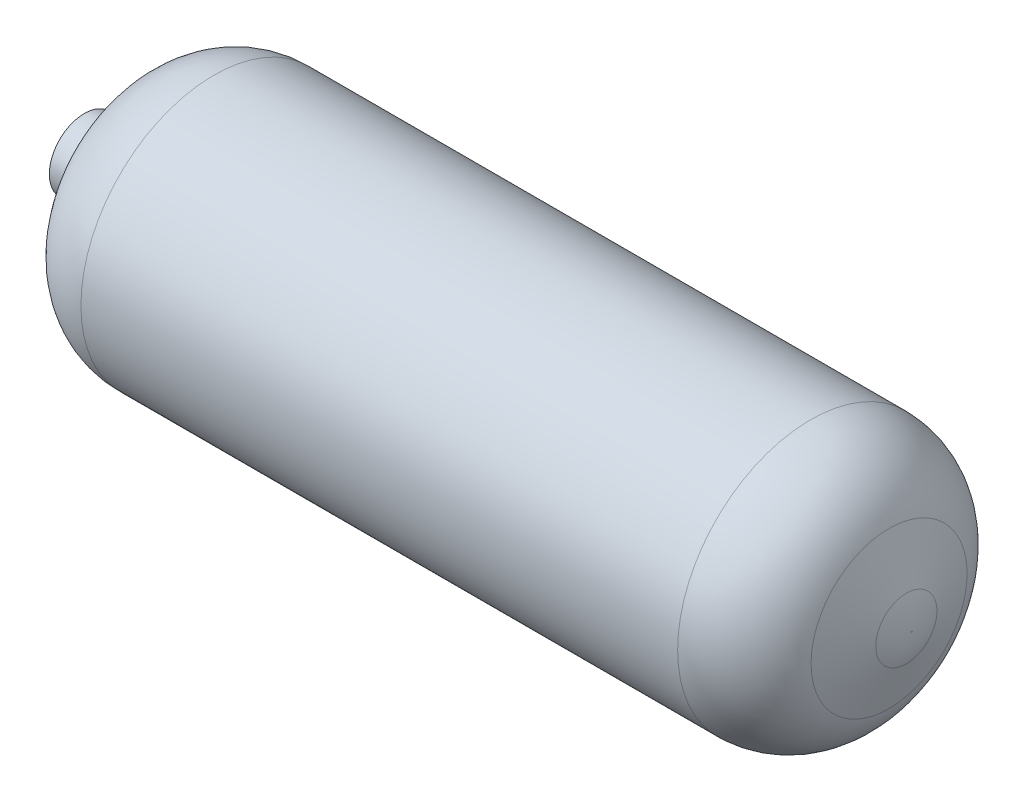
ISO-10303-21;
HEADER;
FILE_DESCRIPTION(('STEP AP214'),'2;1');
FILE_NAME('part.step','',(''),(''),'','','');
FILE_SCHEMA(('AUTOMOTIVE_DESIGN { 1 0 10303 214 1 1 1 1 }'));
ENDSEC;
DATA;
#1=APPLICATION_CONTEXT('core data for automotive mechanical design processes');
#2=APPLICATION_PROTOCOL_DEFINITION('international standard','automotive_design',2000,#1);
#3=PRODUCT_CONTEXT('',#1,'mechanical');
#4=PRODUCT('Part','Part','',(#3));
#5=PRODUCT_RELATED_PRODUCT_CATEGORY('part','',(#4));
#6=PRODUCT_DEFINITION_FORMATION('','',#4);
#7=PRODUCT_DEFINITION_CONTEXT('part definition',#1,'design');
#8=PRODUCT_DEFINITION('design','',#6,#7);
#9=PRODUCT_DEFINITION_SHAPE('','',#8);
#10=(LENGTH_UNIT() NAMED_UNIT(*) SI_UNIT(.MILLI.,.METRE.));
#11=(NAMED_UNIT(*) PLANE_ANGLE_UNIT() SI_UNIT($,.RADIAN.));
#12=(NAMED_UNIT(*) SI_UNIT($,.STERADIAN.) SOLID_ANGLE_UNIT());
#13=UNCERTAINTY_MEASURE_WITH_UNIT(LENGTH_MEASURE(1.E-05),#10,'distance_accuracy_value','');
#14=(GEOMETRIC_REPRESENTATION_CONTEXT(3) GLOBAL_UNCERTAINTY_ASSIGNED_CONTEXT((#13)) GLOBAL_UNIT_ASSIGNED_CONTEXT((#10,
#11,#12)) REPRESENTATION_CONTEXT('',''));
#15=CARTESIAN_POINT('',(0.,0.,0.));
#16=DIRECTION('',(0.,0.,1.));
#17=DIRECTION('',(1.,0.,0.));
#18=AXIS2_PLACEMENT_3D('',#15,#16,#17);
#19=CARTESIAN_POINT('',(-242.271269759622,0.,0.));
#20=DIRECTION('',(1.,0.,0.));
#21=DIRECTION('',(0.,0.,-1.));
#22=AXIS2_PLACEMENT_3D('',#19,#20,#21);
#23=CONICAL_SURFACE('',#22,23.866436766229,1.09955742875643);
#24=CARTESIAN_POINT('',(-226.546463052101,0.,0.));
#25=DIRECTION('',(-1.,0.,0.));
#26=DIRECTION('',(0.,0.,1.));
#27=AXIS2_PLACEMENT_3D('',#24,#25,#26);
#28=CIRCLE('',#27,54.7281076074481);
#29=CARTESIAN_POINT('',(-226.546463052101,0.,54.7281076074481));
#30=VERTEX_POINT('',#29);
#31=EDGE_CURVE('E120',#30,#30,#28,.T.);
#32=ORIENTED_EDGE('',*,*,#31,.T.);
#33=EDGE_LOOP('',(#32));
#34=FACE_BOUND('',#33,.T.);
#35=CARTESIAN_POINT('',(-242.271269759622,0.,0.));
#36=DIRECTION('',(-1.,0.,0.));
#37=DIRECTION('',(0.,0.,1.));
#38=AXIS2_PLACEMENT_3D('',#35,#36,#37);
#39=CIRCLE('',#38,23.866436766229);
#40=CARTESIAN_POINT('',(-242.271269759622,0.,23.866436766229));
#41=VERTEX_POINT('',#40);
#42=EDGE_CURVE('E56',#41,#41,#39,.T.);
#43=ORIENTED_EDGE('',*,*,#42,.F.);
#44=EDGE_LOOP('',(#43));
#45=FACE_BOUND('',#44,.T.);
#46=ADVANCED_FACE('F37',(#34,#45),#23,.T.);
#47=CARTESIAN_POINT('',(-245.166734472183,0.,0.));
#48=DIRECTION('',(-1.,0.,0.));
#49=DIRECTION('',(0.,0.,1.));
#50=AXIS2_PLACEMENT_3D('',#47,#48,#49);
#51=TOROIDAL_SURFACE('',#50,25.3417497253921,3.24965601705214);
#52=CARTESIAN_POINT('',(-245.166734472183,0.,0.));
#53=DIRECTION('',(-1.,0.,0.));
#54=DIRECTION('',(0.,0.,1.));
#55=AXIS2_PLACEMENT_3D('',#52,#53,#54);
#56=CIRCLE('',#55,22.09209370834);
#57=CARTESIAN_POINT('',(-245.166734472183,0.,22.09209370834));
#58=VERTEX_POINT('',#57);
#59=EDGE_CURVE('E88',#58,#58,#56,.T.);
#60=ORIENTED_EDGE('',*,*,#59,.F.);
#61=EDGE_LOOP('',(#60));
#62=FACE_BOUND('',#61,.T.);
#63=ORIENTED_EDGE('',*,*,#42,.T.);
#64=EDGE_LOOP('',(#63));
#65=FACE_BOUND('',#64,.T.);
#66=ADVANCED_FACE('F145',(#62,#65),#51,.F.);
#67=CARTESIAN_POINT('',(-260.719194131512,0.,0.));
#68=DIRECTION('',(-1.,0.,0.));
#69=DIRECTION('',(0.,0.,1.));
#70=AXIS2_PLACEMENT_3D('',#67,#68,#69);
#71=CYLINDRICAL_SURFACE('',#70,22.09209370834);
#72=ORIENTED_EDGE('',*,*,#59,.T.);
#73=EDGE_LOOP('',(#72));
#74=FACE_BOUND('',#73,.T.);
#75=CARTESIAN_POINT('',(-260.719194131512,0.,0.));
#76=DIRECTION('',(-1.,0.,0.));
#77=DIRECTION('',(0.,0.,1.));
#78=AXIS2_PLACEMENT_3D('',#75,#76,#77);
#79=CIRCLE('',#78,22.09209370834);
#80=CARTESIAN_POINT('',(-260.719194131512,0.,22.09209370834));
#81=VERTEX_POINT('',#80);
#82=EDGE_CURVE('E93',#81,#81,#79,.T.);
#83=ORIENTED_EDGE('',*,*,#82,.F.);
#84=EDGE_LOOP('',(#83));
#85=FACE_BOUND('',#84,.T.);
#86=ADVANCED_FACE('F150',(#74,#85),#71,.T.);
#87=CARTESIAN_POINT('',(-260.719194131512,0.,0.));
#88=DIRECTION('',(1.,0.,0.));
#89=DIRECTION('',(0.,0.,-1.));
#90=AXIS2_PLACEMENT_3D('',#87,#88,#89);
#91=PLANE('',#90);
#92=ORIENTED_EDGE('',*,*,#82,.T.);
#93=EDGE_LOOP('',(#92));
#94=FACE_BOUND('',#93,.T.);
#95=ADVANCED_FACE('F292',(#94),#91,.F.);
#96=CARTESIAN_POINT('',(260.719194131512,0.,0.));
#97=DIRECTION('',(-1.,0.,0.));
#98=DIRECTION('',(0.,0.,1.));
#99=AXIS2_PLACEMENT_3D('',#96,#97,#98);
#100=PLANE('',#99);
#101=CARTESIAN_POINT('',(260.719194131512,0.,0.));
#102=DIRECTION('',(-1.,0.,0.));
#103=DIRECTION('',(0.,0.,1.));
#104=AXIS2_PLACEMENT_3D('',#101,#102,#103);
#105=CIRCLE('',#104,0.381787731454405);
#106=CARTESIAN_POINT('',(260.719194131512,0.,0.381787731454405));
#107=VERTEX_POINT('',#106);
#108=EDGE_CURVE('E98',#107,#107,#105,.T.);
#109=ORIENTED_EDGE('',*,*,#108,.F.);
#110=EDGE_LOOP('',(#109));
#111=FACE_BOUND('',#110,.T.);
#112=ADVANCED_FACE('F283',(#111),#100,.F.);
#113=CARTESIAN_POINT('',(205.488959860663,0.,0.));
#114=DIRECTION('',(-1.,0.,0.));
#115=DIRECTION('',(0.,0.,1.));
#116=AXIS2_PLACEMENT_3D('',#113,#114,#115);
#117=DEGENERATE_TOROIDAL_SURFACE('',#116,0.381787731454405,55.23023427085,.T.);
#118=CARTESIAN_POINT('',(257.388403449257,0.,0.));
#119=DIRECTION('',(-1.,0.,0.));
#120=DIRECTION('',(0.,0.,1.));
#121=AXIS2_PLACEMENT_3D('',#118,#119,#120);
#122=CIRCLE('',#121,19.2716403726806);
#123=CARTESIAN_POINT('',(257.388403449257,0.,19.2716403726806));
#124=VERTEX_POINT('',#123);
#125=EDGE_CURVE('E104',#124,#124,#122,.T.);
#126=ORIENTED_EDGE('',*,*,#125,.F.);
#127=EDGE_LOOP('',(#126));
#128=FACE_BOUND('',#127,.T.);
#129=ORIENTED_EDGE('',*,*,#108,.T.);
#130=EDGE_LOOP('',(#129));
#131=FACE_BOUND('',#130,.T.);
#132=ADVANCED_FACE('F274',(#128,#131),#117,.T.);
#133=CARTESIAN_POINT('',(246.499099686017,0.,0.));
#134=DIRECTION('',(-1.,0.,0.));
#135=DIRECTION('',(0.,0.,1.));
#136=AXIS2_PLACEMENT_3D('',#133,#134,#135);
#137=CONICAL_SURFACE('',#136,49.1897565757662,1.22173047639603);
#138=ORIENTED_EDGE('',*,*,#125,.T.);
#139=EDGE_LOOP('',(#138));
#140=FACE_BOUND('',#139,.T.);
#141=CARTESIAN_POINT('',(246.499099686017,0.,0.));
#142=DIRECTION('',(-1.,0.,0.));
#143=DIRECTION('',(0.,0.,1.));
#144=AXIS2_PLACEMENT_3D('',#141,#142,#143);
#145=CIRCLE('',#144,49.1897565757662);
#146=CARTESIAN_POINT('',(246.499099686017,0.,49.1897565757662));
#147=VERTEX_POINT('',#146);
#148=EDGE_CURVE('E108',#147,#147,#145,.T.);
#149=ORIENTED_EDGE('',*,*,#148,.F.);
#150=EDGE_LOOP('',(#149));
#151=FACE_BOUND('',#150,.T.);
#152=ADVANCED_FACE('F141',(#140,#151),#137,.T.);
#153=CARTESIAN_POINT('',(197.041982854532,0.,0.));
#154=DIRECTION('',(-1.,0.,0.));
#155=DIRECTION('',(0.,0.,1.));
#156=AXIS2_PLACEMENT_3D('',#153,#154,#155);
#157=DEGENERATE_TOROIDAL_SURFACE('',#156,31.18883817648,52.63116442281,.T.);
#158=ORIENTED_EDGE('',*,*,#148,.T.);
#159=EDGE_LOOP('',(#158));
#160=FACE_BOUND('',#159,.T.);
#161=CARTESIAN_POINT('',(197.041982854532,0.,0.));
#162=DIRECTION('',(-1.,0.,0.));
#163=DIRECTION('',(0.,0.,1.));
#164=AXIS2_PLACEMENT_3D('',#161,#162,#163);
#165=CIRCLE('',#164,83.82000259929);
#166=CARTESIAN_POINT('',(197.041982854532,0.,83.82000259929));
#167=VERTEX_POINT('',#166);
#168=EDGE_CURVE('E112',#167,#167,#165,.T.);
#169=ORIENTED_EDGE('',*,*,#168,.F.);
#170=EDGE_LOOP('',(#169));
#171=FACE_BOUND('',#170,.T.);
#172=ADVANCED_FACE('F135',(#160,#171),#157,.T.);
#173=CARTESIAN_POINT('',(-260.719194131512,0.,0.));
#174=DIRECTION('',(-1.,0.,0.));
#175=DIRECTION('',(0.,0.,1.));
#176=AXIS2_PLACEMENT_3D('',#173,#174,#175);
#177=CYLINDRICAL_SURFACE('',#176,83.82000259929);
#178=ORIENTED_EDGE('',*,*,#168,.T.);
#179=EDGE_LOOP('',(#178));
#180=FACE_BOUND('',#179,.T.);
#181=CARTESIAN_POINT('',(-179.07280512789,0.,0.));
#182=DIRECTION('',(-1.,0.,0.));
#183=DIRECTION('',(0.,0.,1.));
#184=AXIS2_PLACEMENT_3D('',#181,#182,#183);
#185=CIRCLE('',#184,83.82000259929);
#186=CARTESIAN_POINT('',(-179.07280512789,0.,83.82000259929));
#187=VERTEX_POINT('',#186);
#188=EDGE_CURVE('E116',#187,#187,#185,.T.);
#189=ORIENTED_EDGE('',*,*,#188,.F.);
#190=EDGE_LOOP('',(#189));
#191=FACE_BOUND('',#190,.T.);
#192=ADVANCED_FACE('F130',(#180,#191),#177,.T.);
#193=CARTESIAN_POINT('',(-179.07280512789,0.,0.));
#194=DIRECTION('',(-1.,0.,0.));
#195=DIRECTION('',(0.,0.,1.));
#196=AXIS2_PLACEMENT_3D('',#193,#194,#195);
#197=DEGENERATE_TOROIDAL_SURFACE('',#196,30.53907071447,53.28093188482,.T.);
#198=ORIENTED_EDGE('',*,*,#31,.F.);
#199=EDGE_LOOP('',(#198));
#200=FACE_BOUND('',#199,.T.);
#201=ORIENTED_EDGE('',*,*,#188,.T.);
#202=EDGE_LOOP('',(#201));
#203=FACE_BOUND('',#202,.T.);
#204=ADVANCED_FACE('F127',(#200,#203),#197,.T.);
#205=CLOSED_SHELL('',(#46,#66,#86,#95,#112,#132,#152,#172,#192,#204));
#206=CARTESIAN_POINT('',(-237.292325302457,0.,0.));
#207=DIRECTION('',(1.,0.,0.));
#208=DIRECTION('',(0.,0.,-1.));
#209=AXIS2_PLACEMENT_3D('',#206,#207,#208);
#210=CONICAL_SURFACE('',#209,21.3295378536845,1.09955742875643);
#211=CARTESIAN_POINT('',(-221.567518594936,0.,0.));
#212=DIRECTION('',(1.,0.,0.));
#213=DIRECTION('',(0.,0.,-1.));
#214=AXIS2_PLACEMENT_3D('',#211,#212,#213);
#215=CIRCLE('',#214,52.1912086949035);
#216=CARTESIAN_POINT('',(-221.567518594936,0.,-52.1912086949035));
#217=VERTEX_POINT('',#216);
#218=EDGE_CURVE('E41',#217,#217,#215,.F.);
#219=ORIENTED_EDGE('',*,*,#218,.F.);
#220=EDGE_LOOP('',(#219));
#221=FACE_BOUND('',#220,.T.);
#222=CARTESIAN_POINT('',(-237.292325302457,0.,0.));
#223=DIRECTION('',(-1.,0.,0.));
#224=DIRECTION('',(0.,0.,1.));
#225=AXIS2_PLACEMENT_3D('',#222,#223,#224);
#226=CIRCLE('',#225,21.3295378536845);
#227=CARTESIAN_POINT('',(-237.292325302457,0.,21.3295378536845));
#228=VERTEX_POINT('',#227);
#229=EDGE_CURVE('E77',#228,#228,#226,.T.);
#230=ORIENTED_EDGE('',*,*,#229,.T.);
#231=EDGE_LOOP('',(#230));
#232=FACE_BOUND('',#231,.T.);
#233=ADVANCED_FACE('F155',(#221,#232),#210,.F.);
#234=CARTESIAN_POINT('',(-245.166734472183,0.,0.));
#235=DIRECTION('',(-1.,0.,0.));
#236=DIRECTION('',(0.,0.,1.));
#237=AXIS2_PLACEMENT_3D('',#234,#235,#236);
#238=TOROIDAL_SURFACE('',#237,25.3417497253921,8.83765601705214);
#239=CARTESIAN_POINT('',(-245.166734472183,0.,0.));
#240=DIRECTION('',(-1.,0.,0.));
#241=DIRECTION('',(0.,0.,1.));
#242=AXIS2_PLACEMENT_3D('',#239,#240,#241);
#243=CIRCLE('',#242,16.50409370834);
#244=CARTESIAN_POINT('',(-245.166734472183,0.,16.50409370834));
#245=VERTEX_POINT('',#244);
#246=EDGE_CURVE('E74',#245,#245,#243,.T.);
#247=ORIENTED_EDGE('',*,*,#246,.T.);
#248=EDGE_LOOP('',(#247));
#249=FACE_BOUND('',#248,.T.);
#250=ORIENTED_EDGE('',*,*,#229,.F.);
#251=EDGE_LOOP('',(#250));
#252=FACE_BOUND('',#251,.T.);
#253=ADVANCED_FACE('F158',(#249,#252),#238,.T.);
#254=CARTESIAN_POINT('',(-260.719194131512,0.,0.));
#255=DIRECTION('',(-1.,0.,0.));
#256=DIRECTION('',(0.,0.,1.));
#257=AXIS2_PLACEMENT_3D('',#254,#255,#256);
#258=CYLINDRICAL_SURFACE('',#257,16.50409370834);
#259=ORIENTED_EDGE('',*,*,#246,.F.);
#260=EDGE_LOOP('',(#259));
#261=FACE_BOUND('',#260,.T.);
#262=CARTESIAN_POINT('',(-255.131194131513,0.,0.));
#263=DIRECTION('',(1.,0.,0.));
#264=DIRECTION('',(0.,0.,-1.));
#265=AXIS2_PLACEMENT_3D('',#262,#263,#264);
#266=CIRCLE('',#265,16.50409370834);
#267=CARTESIAN_POINT('',(-255.131194131513,0.,-16.50409370834));
#268=VERTEX_POINT('',#267);
#269=EDGE_CURVE('E70',#268,#268,#266,.F.);
#270=ORIENTED_EDGE('',*,*,#269,.T.);
#271=EDGE_LOOP('',(#270));
#272=FACE_BOUND('',#271,.T.);
#273=ADVANCED_FACE('F163',(#261,#272),#258,.F.);
#274=CARTESIAN_POINT('',(-255.131194131513,0.,0.));
#275=DIRECTION('',(1.,0.,0.));
#276=DIRECTION('',(0.,0.,-1.));
#277=AXIS2_PLACEMENT_3D('',#274,#275,#276);
#278=PLANE('',#277);
#279=ORIENTED_EDGE('',*,*,#269,.F.);
#280=EDGE_LOOP('',(#279));
#281=FACE_BOUND('',#280,.T.);
#282=ADVANCED_FACE('F167',(#281),#278,.T.);
#283=CARTESIAN_POINT('',(255.131194131513,0.,0.));
#284=DIRECTION('',(-1.,0.,0.));
#285=DIRECTION('',(0.,0.,1.));
#286=AXIS2_PLACEMENT_3D('',#283,#284,#285);
#287=PLANE('',#286);
#288=CARTESIAN_POINT('',(255.131194131513,0.,0.));
#289=DIRECTION('',(-1.,0.,0.));
#290=DIRECTION('',(0.,0.,1.));
#291=AXIS2_PLACEMENT_3D('',#288,#289,#290);
#292=CIRCLE('',#291,0.381787731454408);
#293=CARTESIAN_POINT('',(255.131194131513,0.,0.381787731454408));
#294=VERTEX_POINT('',#293);
#295=EDGE_CURVE('E66',#294,#294,#292,.T.);
#296=ORIENTED_EDGE('',*,*,#295,.T.);
#297=EDGE_LOOP('',(#296));
#298=FACE_BOUND('',#297,.T.);
#299=ADVANCED_FACE('F171',(#298),#287,.T.);
#300=CARTESIAN_POINT('',(205.488959860663,0.,0.));
#301=DIRECTION('',(-1.,0.,0.));
#302=DIRECTION('',(0.,0.,1.));
#303=AXIS2_PLACEMENT_3D('',#300,#301,#302);
#304=DEGENERATE_TOROIDAL_SURFACE('',#303,0.381787731454405,49.64223427085,.T.);
#305=CARTESIAN_POINT('',(252.137401084306,0.,0.));
#306=DIRECTION('',(-1.,0.,0.));
#307=DIRECTION('',(0.,0.,1.));
#308=AXIS2_PLACEMENT_3D('',#305,#306,#307);
#309=CIRCLE('',#308,17.3604318117768);
#310=CARTESIAN_POINT('',(252.137401084306,0.,17.3604318117768));
#311=VERTEX_POINT('',#310);
#312=EDGE_CURVE('E62',#311,#311,#309,.T.);
#313=ORIENTED_EDGE('',*,*,#312,.T.);
#314=EDGE_LOOP('',(#313));
#315=FACE_BOUND('',#314,.T.);
#316=ORIENTED_EDGE('',*,*,#295,.F.);
#317=EDGE_LOOP('',(#316));
#318=FACE_BOUND('',#317,.T.);
#319=ADVANCED_FACE('F175',(#315,#318),#304,.F.);
#320=CARTESIAN_POINT('',(241.248097321065,0.,0.));
#321=DIRECTION('',(-1.,0.,0.));
#322=DIRECTION('',(0.,0.,1.));
#323=AXIS2_PLACEMENT_3D('',#320,#321,#322);
#324=CONICAL_SURFACE('',#323,47.2785480148624,1.22173047639603);
#325=ORIENTED_EDGE('',*,*,#312,.F.);
#326=EDGE_LOOP('',(#325));
#327=FACE_BOUND('',#326,.T.);
#328=CARTESIAN_POINT('',(241.248097321065,0.,0.));
#329=DIRECTION('',(-1.,0.,0.));
#330=DIRECTION('',(0.,0.,1.));
#331=AXIS2_PLACEMENT_3D('',#328,#329,#330);
#332=CIRCLE('',#331,47.2785480148624);
#333=CARTESIAN_POINT('',(241.248097321065,0.,47.2785480148624));
#334=VERTEX_POINT('',#333);
#335=EDGE_CURVE('E53',#334,#334,#332,.T.);
#336=ORIENTED_EDGE('',*,*,#335,.T.);
#337=EDGE_LOOP('',(#336));
#338=FACE_BOUND('',#337,.T.);
#339=ADVANCED_FACE('F179',(#327,#338),#324,.F.);
#340=CARTESIAN_POINT('',(197.041982854532,0.,0.));
#341=DIRECTION('',(-1.,0.,0.));
#342=DIRECTION('',(0.,0.,1.));
#343=AXIS2_PLACEMENT_3D('',#340,#341,#342);
#344=DEGENERATE_TOROIDAL_SURFACE('',#343,31.18883817648,47.04316442281,.T.);
#345=ORIENTED_EDGE('',*,*,#335,.F.);
#346=EDGE_LOOP('',(#345));
#347=FACE_BOUND('',#346,.T.);
#348=CARTESIAN_POINT('',(197.041982854532,0.,0.));
#349=DIRECTION('',(-1.,0.,0.));
#350=DIRECTION('',(0.,0.,1.));
#351=AXIS2_PLACEMENT_3D('',#348,#349,#350);
#352=CIRCLE('',#351,78.23200259929);
#353=CARTESIAN_POINT('',(197.041982854532,0.,78.23200259929));
#354=VERTEX_POINT('',#353);
#355=EDGE_CURVE('E47',#354,#354,#352,.T.);
#356=ORIENTED_EDGE('',*,*,#355,.T.);
#357=EDGE_LOOP('',(#356));
#358=FACE_BOUND('',#357,.T.);
#359=ADVANCED_FACE('F183',(#347,#358),#344,.F.);
#360=CARTESIAN_POINT('',(-260.719194131512,0.,0.));
#361=DIRECTION('',(-1.,0.,0.));
#362=DIRECTION('',(0.,0.,1.));
#363=AXIS2_PLACEMENT_3D('',#360,#361,#362);
#364=CYLINDRICAL_SURFACE('',#363,78.23200259929);
#365=ORIENTED_EDGE('',*,*,#355,.F.);
#366=EDGE_LOOP('',(#365));
#367=FACE_BOUND('',#366,.T.);
#368=CARTESIAN_POINT('',(-179.07280512789,0.,0.));
#369=DIRECTION('',(-1.,0.,0.));
#370=DIRECTION('',(0.,0.,1.));
#371=AXIS2_PLACEMENT_3D('',#368,#369,#370);
#372=CIRCLE('',#371,78.23200259929);
#373=CARTESIAN_POINT('',(-179.07280512789,0.,78.23200259929));
#374=VERTEX_POINT('',#373);
#375=EDGE_CURVE('E10',#374,#374,#372,.T.);
#376=ORIENTED_EDGE('',*,*,#375,.T.);
#377=EDGE_LOOP('',(#376));
#378=FACE_BOUND('',#377,.T.);
#379=ADVANCED_FACE('F186',(#367,#378),#364,.F.);
#380=CARTESIAN_POINT('',(-179.07280512789,0.,0.));
#381=DIRECTION('',(-1.,0.,0.));
#382=DIRECTION('',(0.,0.,1.));
#383=AXIS2_PLACEMENT_3D('',#380,#381,#382);
#384=DEGENERATE_TOROIDAL_SURFACE('',#383,30.53907071447,47.69293188482,.T.);
#385=ORIENTED_EDGE('',*,*,#218,.T.);
#386=EDGE_LOOP('',(#385));
#387=FACE_BOUND('',#386,.T.);
#388=ORIENTED_EDGE('',*,*,#375,.F.);
#389=EDGE_LOOP('',(#388));
#390=FACE_BOUND('',#389,.T.);
#391=ADVANCED_FACE('F39',(#387,#390),#384,.F.);
#392=CLOSED_SHELL('',(#233,#253,#273,#282,#299,#319,#339,#359,#379,#391));
#393=ORIENTED_CLOSED_SHELL('',*,#392,.T.);
#394=BREP_WITH_VOIDS('B2',#205,(#393));
#395=ADVANCED_BREP_SHAPE_REPRESENTATION('',(#18,#394),#14);
#396=SHAPE_DEFINITION_REPRESENTATION(#9,#395);
ENDSEC;
END-ISO-10303-21;
